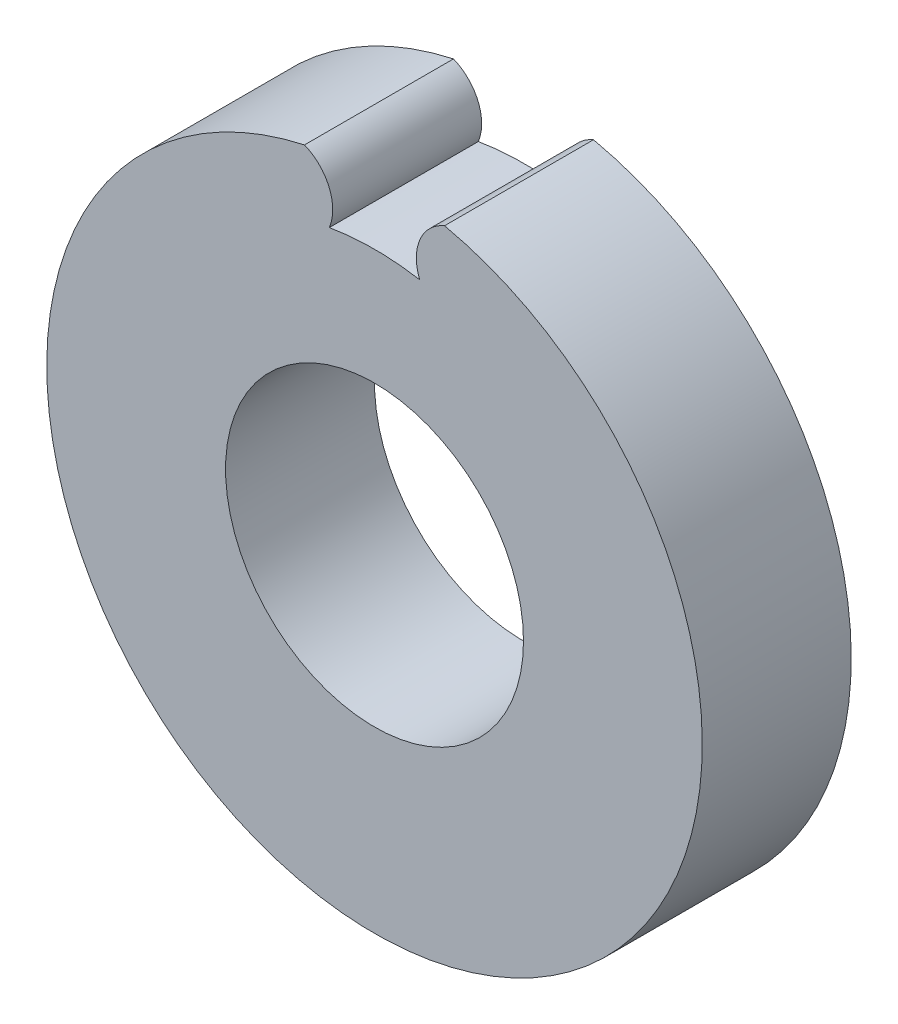
ISO-10303-21;
HEADER;
FILE_DESCRIPTION(('STEP AP214'),'2;1');
FILE_NAME('part.step','',(''),(''),'','','');
FILE_SCHEMA(('AUTOMOTIVE_DESIGN { 1 0 10303 214 1 1 1 1 }'));
ENDSEC;
DATA;
#1=APPLICATION_CONTEXT('core data for automotive mechanical design processes');
#2=APPLICATION_PROTOCOL_DEFINITION('international standard','automotive_design',2000,#1);
#3=PRODUCT_CONTEXT('',#1,'mechanical');
#4=PRODUCT('Part','Part','',(#3));
#5=PRODUCT_RELATED_PRODUCT_CATEGORY('part','',(#4));
#6=PRODUCT_DEFINITION_FORMATION('','',#4);
#7=PRODUCT_DEFINITION_CONTEXT('part definition',#1,'design');
#8=PRODUCT_DEFINITION('design','',#6,#7);
#9=PRODUCT_DEFINITION_SHAPE('','',#8);
#10=(LENGTH_UNIT() NAMED_UNIT(*) SI_UNIT(.MILLI.,.METRE.));
#11=(NAMED_UNIT(*) PLANE_ANGLE_UNIT() SI_UNIT($,.RADIAN.));
#12=(NAMED_UNIT(*) SI_UNIT($,.STERADIAN.) SOLID_ANGLE_UNIT());
#13=UNCERTAINTY_MEASURE_WITH_UNIT(LENGTH_MEASURE(1.E-05),#10,'distance_accuracy_value','');
#14=(GEOMETRIC_REPRESENTATION_CONTEXT(3) GLOBAL_UNCERTAINTY_ASSIGNED_CONTEXT((#13)) GLOBAL_UNIT_ASSIGNED_CONTEXT((#10,
#11,#12)) REPRESENTATION_CONTEXT('',''));
#15=CARTESIAN_POINT('',(0.,0.,0.));
#16=DIRECTION('',(0.,0.,1.));
#17=DIRECTION('',(1.,0.,0.));
#18=AXIS2_PLACEMENT_3D('',#15,#16,#17);
#19=CARTESIAN_POINT('',(0.,0.,6.));
#20=DIRECTION('',(0.,0.,1.));
#21=DIRECTION('',(1.,0.,0.));
#22=AXIS2_PLACEMENT_3D('',#19,#20,#21);
#23=PLANE('',#22);
#24=CARTESIAN_POINT('',(0.,0.,6.));
#25=DIRECTION('',(0.,0.,1.));
#26=DIRECTION('',(1.,0.,0.));
#27=AXIS2_PLACEMENT_3D('',#24,#25,#26);
#28=CIRCLE('',#27,6.);
#29=CARTESIAN_POINT('',(6.,0.,6.));
#30=VERTEX_POINT('',#29);
#31=EDGE_CURVE('E125',#30,#30,#28,.T.);
#32=ORIENTED_EDGE('',*,*,#31,.F.);
#33=EDGE_LOOP('',(#32));
#34=FACE_BOUND('',#33,.T.);
#35=CARTESIAN_POINT('',(-3.51149491481481,11.2036437434838,6.));
#36=DIRECTION('',(0.,0.,-1.));
#37=DIRECTION('',(-1.,0.,0.));
#38=AXIS2_PLACEMENT_3D('',#35,#36,#37);
#39=CIRCLE('',#38,1.82757479266053);
#40=CARTESIAN_POINT('',(-2.81985117133101,12.8952874869676,6.));
#41=VERTEX_POINT('',#40);
#42=CARTESIAN_POINT('',(-1.81985117133101,10.512,6.));
#43=VERTEX_POINT('',#42);
#44=EDGE_CURVE('E111',#41,#43,#39,.T.);
#45=ORIENTED_EDGE('',*,*,#44,.F.);
#46=CARTESIAN_POINT('',(0.,0.,6.));
#47=DIRECTION('',(0.,0.,1.));
#48=DIRECTION('',(1.,0.,0.));
#49=AXIS2_PLACEMENT_3D('',#46,#47,#48);
#50=CIRCLE('',#49,13.2);
#51=CARTESIAN_POINT('',(2.81985117133101,12.8952874869676,6.));
#52=VERTEX_POINT('',#51);
#53=EDGE_CURVE('E11',#41,#52,#50,.T.);
#54=ORIENTED_EDGE('',*,*,#53,.T.);
#55=CARTESIAN_POINT('',(3.51149491481482,11.2036437434838,6.));
#56=DIRECTION('',(0.,0.,1.));
#57=DIRECTION('',(1.,0.,0.));
#58=AXIS2_PLACEMENT_3D('',#55,#56,#57);
#59=CIRCLE('',#58,1.82757479266053);
#60=CARTESIAN_POINT('',(1.81985117133101,10.512,6.));
#61=VERTEX_POINT('',#60);
#62=EDGE_CURVE('E57',#52,#61,#59,.T.);
#63=ORIENTED_EDGE('',*,*,#62,.T.);
#64=CARTESIAN_POINT('',(0.,0.,6.));
#65=DIRECTION('',(0.,0.,-1.));
#66=DIRECTION('',(-1.,0.,0.));
#67=AXIS2_PLACEMENT_3D('',#64,#65,#66);
#68=CIRCLE('',#67,10.6683645553475);
#69=EDGE_CURVE('E102',#43,#61,#68,.T.);
#70=ORIENTED_EDGE('',*,*,#69,.F.);
#71=EDGE_LOOP('',(#45,#54,#63,#70));
#72=FACE_BOUND('',#71,.T.);
#73=ADVANCED_FACE('F41',(#34,#72),#23,.T.);
#74=CARTESIAN_POINT('',(0.,0.,0.));
#75=DIRECTION('',(0.,0.,1.));
#76=DIRECTION('',(1.,0.,0.));
#77=AXIS2_PLACEMENT_3D('',#74,#75,#76);
#78=PLANE('',#77);
#79=CARTESIAN_POINT('',(0.,0.,0.));
#80=DIRECTION('',(0.,0.,1.));
#81=DIRECTION('',(1.,0.,0.));
#82=AXIS2_PLACEMENT_3D('',#79,#80,#81);
#83=CIRCLE('',#82,6.);
#84=CARTESIAN_POINT('',(6.,0.,0.));
#85=VERTEX_POINT('',#84);
#86=EDGE_CURVE('E120',#85,#85,#83,.T.);
#87=ORIENTED_EDGE('',*,*,#86,.T.);
#88=EDGE_LOOP('',(#87));
#89=FACE_BOUND('',#88,.T.);
#90=CARTESIAN_POINT('',(0.,0.,0.));
#91=DIRECTION('',(0.,0.,1.));
#92=DIRECTION('',(1.,0.,0.));
#93=AXIS2_PLACEMENT_3D('',#90,#91,#92);
#94=CIRCLE('',#93,13.2);
#95=CARTESIAN_POINT('',(-2.81985117133101,12.8952874869676,0.));
#96=VERTEX_POINT('',#95);
#97=CARTESIAN_POINT('',(2.81985117133101,12.8952874869676,0.));
#98=VERTEX_POINT('',#97);
#99=EDGE_CURVE('E45',#96,#98,#94,.T.);
#100=ORIENTED_EDGE('',*,*,#99,.F.);
#101=CARTESIAN_POINT('',(-3.51149491481481,11.2036437434838,0.));
#102=DIRECTION('',(0.,0.,-1.));
#103=DIRECTION('',(-1.,0.,0.));
#104=AXIS2_PLACEMENT_3D('',#101,#102,#103);
#105=CIRCLE('',#104,1.82757479266053);
#106=CARTESIAN_POINT('',(-1.81985117133101,10.512,0.));
#107=VERTEX_POINT('',#106);
#108=EDGE_CURVE('E66',#96,#107,#105,.T.);
#109=ORIENTED_EDGE('',*,*,#108,.T.);
#110=CARTESIAN_POINT('',(0.,0.,0.));
#111=DIRECTION('',(0.,0.,-1.));
#112=DIRECTION('',(-1.,0.,0.));
#113=AXIS2_PLACEMENT_3D('',#110,#111,#112);
#114=CIRCLE('',#113,10.6683645553475);
#115=CARTESIAN_POINT('',(1.81985117133101,10.512,0.));
#116=VERTEX_POINT('',#115);
#117=EDGE_CURVE('E97',#107,#116,#114,.T.);
#118=ORIENTED_EDGE('',*,*,#117,.T.);
#119=CARTESIAN_POINT('',(3.51149491481482,11.2036437434838,0.));
#120=DIRECTION('',(0.,0.,1.));
#121=DIRECTION('',(1.,0.,0.));
#122=AXIS2_PLACEMENT_3D('',#119,#120,#121);
#123=CIRCLE('',#122,1.82757479266053);
#124=EDGE_CURVE('E86',#98,#116,#123,.T.);
#125=ORIENTED_EDGE('',*,*,#124,.F.);
#126=EDGE_LOOP('',(#100,#109,#118,#125));
#127=FACE_BOUND('',#126,.T.);
#128=ADVANCED_FACE('F105',(#89,#127),#78,.F.);
#129=CARTESIAN_POINT('',(0.,0.,6.));
#130=DIRECTION('',(0.,0.,-1.));
#131=DIRECTION('',(-1.,0.,0.));
#132=AXIS2_PLACEMENT_3D('',#129,#130,#131);
#133=CYLINDRICAL_SURFACE('',#132,13.2);
#134=ORIENTED_EDGE('',*,*,#53,.F.);
#135=DIRECTION('',(0.,0.,1.));
#136=VECTOR('',#135,1.);
#137=CARTESIAN_POINT('',(-2.81985117133101,12.8952874869676,0.));
#138=LINE('',#137,#136);
#139=EDGE_CURVE('E79',#96,#41,#138,.T.);
#140=ORIENTED_EDGE('',*,*,#139,.F.);
#141=ORIENTED_EDGE('',*,*,#99,.T.);
#142=DIRECTION('',(0.,0.,1.));
#143=VECTOR('',#142,1.);
#144=CARTESIAN_POINT('',(2.81985117133101,12.8952874869676,0.));
#145=LINE('',#144,#143);
#146=EDGE_CURVE('E91',#98,#52,#145,.T.);
#147=ORIENTED_EDGE('',*,*,#146,.T.);
#148=EDGE_LOOP('',(#134,#140,#141,#147));
#149=FACE_BOUND('',#148,.T.);
#150=ADVANCED_FACE('F43',(#149),#133,.T.);
#151=CARTESIAN_POINT('',(0.,0.,6.));
#152=DIRECTION('',(0.,0.,-1.));
#153=DIRECTION('',(-1.,0.,0.));
#154=AXIS2_PLACEMENT_3D('',#151,#152,#153);
#155=CYLINDRICAL_SURFACE('',#154,6.);
#156=ORIENTED_EDGE('',*,*,#31,.T.);
#157=EDGE_LOOP('',(#156));
#158=FACE_BOUND('',#157,.T.);
#159=ORIENTED_EDGE('',*,*,#86,.F.);
#160=EDGE_LOOP('',(#159));
#161=FACE_BOUND('',#160,.T.);
#162=ADVANCED_FACE('F134',(#158,#161),#155,.F.);
#163=CARTESIAN_POINT('',(-3.51149491481481,11.2036437434838,0.));
#164=DIRECTION('',(0.,0.,1.));
#165=DIRECTION('',(1.,0.,0.));
#166=AXIS2_PLACEMENT_3D('',#163,#164,#165);
#167=CYLINDRICAL_SURFACE('',#166,1.82757479266053);
#168=ORIENTED_EDGE('',*,*,#44,.T.);
#169=DIRECTION('',(0.,0.,1.));
#170=VECTOR('',#169,1.);
#171=CARTESIAN_POINT('',(-1.81985117133101,10.512,0.));
#172=LINE('',#171,#170);
#173=EDGE_CURVE('E82',#107,#43,#172,.T.);
#174=ORIENTED_EDGE('',*,*,#173,.F.);
#175=ORIENTED_EDGE('',*,*,#108,.F.);
#176=ORIENTED_EDGE('',*,*,#139,.T.);
#177=EDGE_LOOP('',(#168,#174,#175,#176));
#178=FACE_BOUND('',#177,.T.);
#179=ADVANCED_FACE('F136',(#178),#167,.T.);
#180=CARTESIAN_POINT('',(3.51149491481482,11.2036437434838,0.));
#181=DIRECTION('',(0.,0.,1.));
#182=DIRECTION('',(1.,0.,0.));
#183=AXIS2_PLACEMENT_3D('',#180,#181,#182);
#184=CYLINDRICAL_SURFACE('',#183,1.82757479266053);
#185=ORIENTED_EDGE('',*,*,#62,.F.);
#186=ORIENTED_EDGE('',*,*,#146,.F.);
#187=ORIENTED_EDGE('',*,*,#124,.T.);
#188=DIRECTION('',(0.,0.,1.));
#189=VECTOR('',#188,1.);
#190=CARTESIAN_POINT('',(1.81985117133101,10.512,0.));
#191=LINE('',#190,#189);
#192=EDGE_CURVE('E89',#116,#61,#191,.T.);
#193=ORIENTED_EDGE('',*,*,#192,.T.);
#194=EDGE_LOOP('',(#185,#186,#187,#193));
#195=FACE_BOUND('',#194,.T.);
#196=ADVANCED_FACE('F88',(#195),#184,.T.);
#197=CARTESIAN_POINT('',(0.,0.,0.));
#198=DIRECTION('',(0.,0.,1.));
#199=DIRECTION('',(1.,0.,0.));
#200=AXIS2_PLACEMENT_3D('',#197,#198,#199);
#201=CYLINDRICAL_SURFACE('',#200,10.6683645553475);
#202=ORIENTED_EDGE('',*,*,#69,.T.);
#203=ORIENTED_EDGE('',*,*,#192,.F.);
#204=ORIENTED_EDGE('',*,*,#117,.F.);
#205=ORIENTED_EDGE('',*,*,#173,.T.);
#206=EDGE_LOOP('',(#202,#203,#204,#205));
#207=FACE_BOUND('',#206,.T.);
#208=ADVANCED_FACE('F100',(#207),#201,.T.);
#209=CLOSED_SHELL('',(#73,#128,#150,#162,#179,#196,#208));
#210=MANIFOLD_SOLID_BREP('B2',#209);
#211=ADVANCED_BREP_SHAPE_REPRESENTATION('',(#18,#210),#14);
#212=SHAPE_DEFINITION_REPRESENTATION(#9,#211);
ENDSEC;
END-ISO-10303-21;
